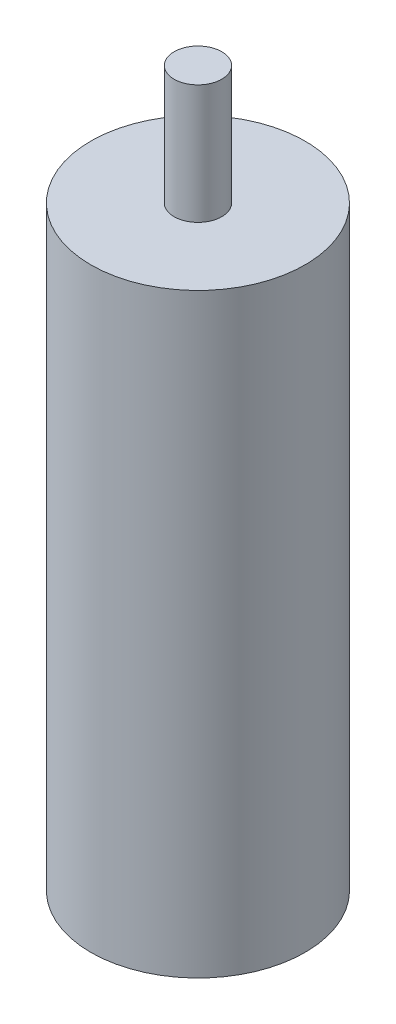
ISO-10303-21;
HEADER;
FILE_DESCRIPTION(('STEP AP214'),'2;1');
FILE_NAME('part.step','',(''),(''),'','','');
FILE_SCHEMA(('AUTOMOTIVE_DESIGN { 1 0 10303 214 1 1 1 1 }'));
ENDSEC;
DATA;
#1=APPLICATION_CONTEXT('core data for automotive mechanical design processes');
#2=APPLICATION_PROTOCOL_DEFINITION('international standard','automotive_design',2000,#1);
#3=PRODUCT_CONTEXT('',#1,'mechanical');
#4=PRODUCT('Part','Part','',(#3));
#5=PRODUCT_RELATED_PRODUCT_CATEGORY('part','',(#4));
#6=PRODUCT_DEFINITION_FORMATION('','',#4);
#7=PRODUCT_DEFINITION_CONTEXT('part definition',#1,'design');
#8=PRODUCT_DEFINITION('design','',#6,#7);
#9=PRODUCT_DEFINITION_SHAPE('','',#8);
#10=(LENGTH_UNIT() NAMED_UNIT(*) SI_UNIT(.MILLI.,.METRE.));
#11=(NAMED_UNIT(*) PLANE_ANGLE_UNIT() SI_UNIT($,.RADIAN.));
#12=(NAMED_UNIT(*) SI_UNIT($,.STERADIAN.) SOLID_ANGLE_UNIT());
#13=UNCERTAINTY_MEASURE_WITH_UNIT(LENGTH_MEASURE(1.E-05),#10,'distance_accuracy_value','');
#14=(GEOMETRIC_REPRESENTATION_CONTEXT(3) GLOBAL_UNCERTAINTY_ASSIGNED_CONTEXT((#13)) GLOBAL_UNIT_ASSIGNED_CONTEXT((#10,
#11,#12)) REPRESENTATION_CONTEXT('',''));
#15=CARTESIAN_POINT('',(0.,0.,0.));
#16=DIRECTION('',(0.,0.,1.));
#17=DIRECTION('',(1.,0.,0.));
#18=AXIS2_PLACEMENT_3D('',#15,#16,#17);
#19=CARTESIAN_POINT('',(0.,125.,0.));
#20=DIRECTION('',(0.,-1.,0.));
#21=DIRECTION('',(0.,0.,-1.));
#22=AXIS2_PLACEMENT_3D('',#19,#20,#21);
#23=CYLINDRICAL_SURFACE('',#22,22.5);
#24=CARTESIAN_POINT('',(0.,125.,0.));
#25=DIRECTION('',(0.,1.,0.));
#26=DIRECTION('',(0.,0.,1.));
#27=AXIS2_PLACEMENT_3D('',#24,#25,#26);
#28=CIRCLE('',#27,22.5);
#29=CARTESIAN_POINT('',(0.,125.,22.5));
#30=VERTEX_POINT('',#29);
#31=EDGE_CURVE('E10',#30,#30,#28,.T.);
#32=ORIENTED_EDGE('',*,*,#31,.F.);
#33=EDGE_LOOP('',(#32));
#34=FACE_BOUND('',#33,.T.);
#35=CARTESIAN_POINT('',(0.,0.,0.));
#36=DIRECTION('',(0.,1.,0.));
#37=DIRECTION('',(0.,0.,1.));
#38=AXIS2_PLACEMENT_3D('',#35,#36,#37);
#39=CIRCLE('',#38,22.5);
#40=CARTESIAN_POINT('',(0.,0.,22.5));
#41=VERTEX_POINT('',#40);
#42=EDGE_CURVE('E37',#41,#41,#39,.T.);
#43=ORIENTED_EDGE('',*,*,#42,.T.);
#44=EDGE_LOOP('',(#43));
#45=FACE_BOUND('',#44,.T.);
#46=ADVANCED_FACE('F34',(#34,#45),#23,.T.);
#47=CARTESIAN_POINT('',(0.,125.,0.));
#48=DIRECTION('',(0.,1.,0.));
#49=DIRECTION('',(0.,0.,1.));
#50=AXIS2_PLACEMENT_3D('',#47,#48,#49);
#51=PLANE('',#50);
#52=CARTESIAN_POINT('',(0.,125.,0.));
#53=DIRECTION('',(0.,1.,0.));
#54=DIRECTION('',(0.,0.,1.));
#55=AXIS2_PLACEMENT_3D('',#52,#53,#54);
#56=CIRCLE('',#55,5.);
#57=CARTESIAN_POINT('',(0.,125.,5.));
#58=VERTEX_POINT('',#57);
#59=EDGE_CURVE('E46',#58,#58,#56,.T.);
#60=ORIENTED_EDGE('',*,*,#59,.F.);
#61=EDGE_LOOP('',(#60));
#62=FACE_BOUND('',#61,.T.);
#63=ORIENTED_EDGE('',*,*,#31,.T.);
#64=EDGE_LOOP('',(#63));
#65=FACE_BOUND('',#64,.T.);
#66=ADVANCED_FACE('F61',(#62,#65),#51,.T.);
#67=CARTESIAN_POINT('',(0.,0.,0.));
#68=DIRECTION('',(0.,1.,0.));
#69=DIRECTION('',(0.,0.,1.));
#70=AXIS2_PLACEMENT_3D('',#67,#68,#69);
#71=PLANE('',#70);
#72=ORIENTED_EDGE('',*,*,#42,.F.);
#73=EDGE_LOOP('',(#72));
#74=FACE_BOUND('',#73,.T.);
#75=ADVANCED_FACE('F57',(#74),#71,.F.);
#76=CARTESIAN_POINT('',(0.,150.,0.));
#77=DIRECTION('',(0.,-1.,0.));
#78=DIRECTION('',(0.,0.,-1.));
#79=AXIS2_PLACEMENT_3D('',#76,#77,#78);
#80=CYLINDRICAL_SURFACE('',#79,5.);
#81=CARTESIAN_POINT('',(0.,150.,0.));
#82=DIRECTION('',(0.,1.,0.));
#83=DIRECTION('',(0.,0.,1.));
#84=AXIS2_PLACEMENT_3D('',#81,#82,#83);
#85=CIRCLE('',#84,5.);
#86=CARTESIAN_POINT('',(0.,150.,5.));
#87=VERTEX_POINT('',#86);
#88=EDGE_CURVE('E44',#87,#87,#85,.T.);
#89=ORIENTED_EDGE('',*,*,#88,.F.);
#90=EDGE_LOOP('',(#89));
#91=FACE_BOUND('',#90,.T.);
#92=ORIENTED_EDGE('',*,*,#59,.T.);
#93=EDGE_LOOP('',(#92));
#94=FACE_BOUND('',#93,.T.);
#95=ADVANCED_FACE('F54',(#91,#94),#80,.T.);
#96=CARTESIAN_POINT('',(0.,150.,0.));
#97=DIRECTION('',(0.,1.,0.));
#98=DIRECTION('',(0.,0.,1.));
#99=AXIS2_PLACEMENT_3D('',#96,#97,#98);
#100=PLANE('',#99);
#101=ORIENTED_EDGE('',*,*,#88,.T.);
#102=EDGE_LOOP('',(#101));
#103=FACE_BOUND('',#102,.T.);
#104=ADVANCED_FACE('F52',(#103),#100,.T.);
#105=CLOSED_SHELL('',(#46,#66,#75,#95,#104));
#106=MANIFOLD_SOLID_BREP('B2',#105);
#107=ADVANCED_BREP_SHAPE_REPRESENTATION('',(#18,#106),#14);
#108=SHAPE_DEFINITION_REPRESENTATION(#9,#107);
ENDSEC;
END-ISO-10303-21;
